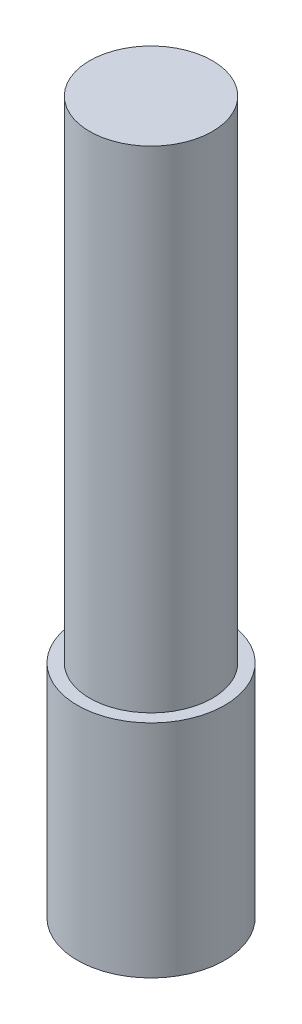
ISO-10303-21;
HEADER;
FILE_DESCRIPTION(('STEP AP214'),'2;1');
FILE_NAME('part.step','',(''),(''),'','','');
FILE_SCHEMA(('AUTOMOTIVE_DESIGN { 1 0 10303 214 1 1 1 1 }'));
ENDSEC;
DATA;
#1=APPLICATION_CONTEXT('core data for automotive mechanical design processes');
#2=APPLICATION_PROTOCOL_DEFINITION('international standard','automotive_design',2000,#1);
#3=PRODUCT_CONTEXT('',#1,'mechanical');
#4=PRODUCT('Part','Part','',(#3));
#5=PRODUCT_RELATED_PRODUCT_CATEGORY('part','',(#4));
#6=PRODUCT_DEFINITION_FORMATION('','',#4);
#7=PRODUCT_DEFINITION_CONTEXT('part definition',#1,'design');
#8=PRODUCT_DEFINITION('design','',#6,#7);
#9=PRODUCT_DEFINITION_SHAPE('','',#8);
#10=(LENGTH_UNIT() NAMED_UNIT(*) SI_UNIT(.MILLI.,.METRE.));
#11=(NAMED_UNIT(*) PLANE_ANGLE_UNIT() SI_UNIT($,.RADIAN.));
#12=(NAMED_UNIT(*) SI_UNIT($,.STERADIAN.) SOLID_ANGLE_UNIT());
#13=UNCERTAINTY_MEASURE_WITH_UNIT(LENGTH_MEASURE(1.E-05),#10,'distance_accuracy_value','');
#14=(GEOMETRIC_REPRESENTATION_CONTEXT(3) GLOBAL_UNCERTAINTY_ASSIGNED_CONTEXT((#13)) GLOBAL_UNIT_ASSIGNED_CONTEXT((#10,
#11,#12)) REPRESENTATION_CONTEXT('',''));
#15=CARTESIAN_POINT('',(0.,0.,0.));
#16=DIRECTION('',(0.,0.,1.));
#17=DIRECTION('',(1.,0.,0.));
#18=AXIS2_PLACEMENT_3D('',#15,#16,#17);
#19=CARTESIAN_POINT('',(3.,0.,0.));
#20=DIRECTION('',(0.,-1.,0.));
#21=DIRECTION('',(0.,0.,-1.));
#22=AXIS2_PLACEMENT_3D('',#19,#20,#21);
#23=PLANE('',#22);
#24=CARTESIAN_POINT('',(0.,0.,0.));
#25=DIRECTION('',(0.,-1.,0.));
#26=DIRECTION('',(0.,0.,-1.));
#27=AXIS2_PLACEMENT_3D('',#24,#25,#26);
#28=CIRCLE('',#27,3.);
#29=CARTESIAN_POINT('',(0.,0.,-3.));
#30=VERTEX_POINT('',#29);
#31=EDGE_CURVE('E10',#30,#30,#28,.T.);
#32=ORIENTED_EDGE('',*,*,#31,.T.);
#33=EDGE_LOOP('',(#32));
#34=FACE_BOUND('',#33,.T.);
#35=ADVANCED_FACE('F30',(#34),#23,.T.);
#36=CARTESIAN_POINT('',(0.,0.,0.));
#37=DIRECTION('',(0.,-1.,0.));
#38=DIRECTION('',(0.,0.,-1.));
#39=AXIS2_PLACEMENT_3D('',#36,#37,#38);
#40=CYLINDRICAL_SURFACE('',#39,3.);
#41=CARTESIAN_POINT('',(0.,9.,0.));
#42=DIRECTION('',(0.,-1.,0.));
#43=DIRECTION('',(0.,0.,-1.));
#44=AXIS2_PLACEMENT_3D('',#41,#42,#43);
#45=CIRCLE('',#44,3.);
#46=CARTESIAN_POINT('',(0.,9.,-3.));
#47=VERTEX_POINT('',#46);
#48=EDGE_CURVE('E36',#47,#47,#45,.T.);
#49=ORIENTED_EDGE('',*,*,#48,.T.);
#50=EDGE_LOOP('',(#49));
#51=FACE_BOUND('',#50,.T.);
#52=ORIENTED_EDGE('',*,*,#31,.F.);
#53=EDGE_LOOP('',(#52));
#54=FACE_BOUND('',#53,.T.);
#55=ADVANCED_FACE('F62',(#51,#54),#40,.T.);
#56=CARTESIAN_POINT('',(3.,9.,0.));
#57=DIRECTION('',(0.,1.,0.));
#58=DIRECTION('',(0.,0.,1.));
#59=AXIS2_PLACEMENT_3D('',#56,#57,#58);
#60=PLANE('',#59);
#61=CARTESIAN_POINT('',(0.,9.,0.));
#62=DIRECTION('',(0.,-1.,0.));
#63=DIRECTION('',(0.,0.,-1.));
#64=AXIS2_PLACEMENT_3D('',#61,#62,#63);
#65=CIRCLE('',#64,2.5);
#66=CARTESIAN_POINT('',(0.,9.,-2.5));
#67=VERTEX_POINT('',#66);
#68=EDGE_CURVE('E40',#67,#67,#65,.T.);
#69=ORIENTED_EDGE('',*,*,#68,.T.);
#70=EDGE_LOOP('',(#69));
#71=FACE_BOUND('',#70,.T.);
#72=ORIENTED_EDGE('',*,*,#48,.F.);
#73=EDGE_LOOP('',(#72));
#74=FACE_BOUND('',#73,.T.);
#75=ADVANCED_FACE('F59',(#71,#74),#60,.T.);
#76=CARTESIAN_POINT('',(0.,0.,0.));
#77=DIRECTION('',(0.,-1.,0.));
#78=DIRECTION('',(0.,0.,-1.));
#79=AXIS2_PLACEMENT_3D('',#76,#77,#78);
#80=CYLINDRICAL_SURFACE('',#79,2.5);
#81=CARTESIAN_POINT('',(0.,29.,0.));
#82=DIRECTION('',(0.,-1.,0.));
#83=DIRECTION('',(0.,0.,-1.));
#84=AXIS2_PLACEMENT_3D('',#81,#82,#83);
#85=CIRCLE('',#84,2.5);
#86=CARTESIAN_POINT('',(0.,29.,-2.5));
#87=VERTEX_POINT('',#86);
#88=EDGE_CURVE('E44',#87,#87,#85,.T.);
#89=ORIENTED_EDGE('',*,*,#88,.T.);
#90=EDGE_LOOP('',(#89));
#91=FACE_BOUND('',#90,.T.);
#92=ORIENTED_EDGE('',*,*,#68,.F.);
#93=EDGE_LOOP('',(#92));
#94=FACE_BOUND('',#93,.T.);
#95=ADVANCED_FACE('F50',(#91,#94),#80,.T.);
#96=CARTESIAN_POINT('',(2.5,29.,0.));
#97=DIRECTION('',(0.,1.,0.));
#98=DIRECTION('',(0.,0.,1.));
#99=AXIS2_PLACEMENT_3D('',#96,#97,#98);
#100=PLANE('',#99);
#101=ORIENTED_EDGE('',*,*,#88,.F.);
#102=EDGE_LOOP('',(#101));
#103=FACE_BOUND('',#102,.T.);
#104=ADVANCED_FACE('F53',(#103),#100,.T.);
#105=CLOSED_SHELL('',(#35,#55,#75,#95,#104));
#106=MANIFOLD_SOLID_BREP('B2',#105);
#107=ADVANCED_BREP_SHAPE_REPRESENTATION('',(#18,#106),#14);
#108=SHAPE_DEFINITION_REPRESENTATION(#9,#107);
ENDSEC;
END-ISO-10303-21;
